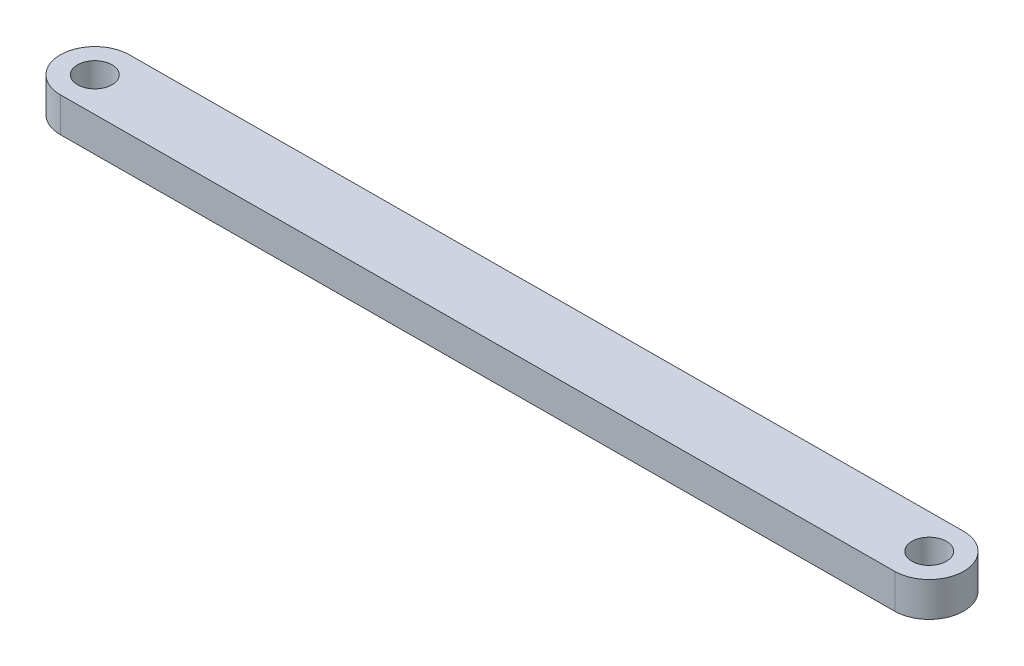
ISO-10303-21;
HEADER;
FILE_DESCRIPTION(('STEP AP214'),'2;1');
FILE_NAME('part.step','',(''),(''),'','','');
FILE_SCHEMA(('AUTOMOTIVE_DESIGN { 1 0 10303 214 1 1 1 1 }'));
ENDSEC;
DATA;
#1=APPLICATION_CONTEXT('core data for automotive mechanical design processes');
#2=APPLICATION_PROTOCOL_DEFINITION('international standard','automotive_design',2000,#1);
#3=PRODUCT_CONTEXT('',#1,'mechanical');
#4=PRODUCT('Part','Part','',(#3));
#5=PRODUCT_RELATED_PRODUCT_CATEGORY('part','',(#4));
#6=PRODUCT_DEFINITION_FORMATION('','',#4);
#7=PRODUCT_DEFINITION_CONTEXT('part definition',#1,'design');
#8=PRODUCT_DEFINITION('design','',#6,#7);
#9=PRODUCT_DEFINITION_SHAPE('','',#8);
#10=(LENGTH_UNIT() NAMED_UNIT(*) SI_UNIT(.MILLI.,.METRE.));
#11=(NAMED_UNIT(*) PLANE_ANGLE_UNIT() SI_UNIT($,.RADIAN.));
#12=(NAMED_UNIT(*) SI_UNIT($,.STERADIAN.) SOLID_ANGLE_UNIT());
#13=UNCERTAINTY_MEASURE_WITH_UNIT(LENGTH_MEASURE(1.E-05),#10,'distance_accuracy_value','');
#14=(GEOMETRIC_REPRESENTATION_CONTEXT(3) GLOBAL_UNCERTAINTY_ASSIGNED_CONTEXT((#13)) GLOBAL_UNIT_ASSIGNED_CONTEXT((#10,
#11,#12)) REPRESENTATION_CONTEXT('',''));
#15=CARTESIAN_POINT('',(0.,0.,0.));
#16=DIRECTION('',(0.,0.,1.));
#17=DIRECTION('',(1.,0.,0.));
#18=AXIS2_PLACEMENT_3D('',#15,#16,#17);
#19=CARTESIAN_POINT('',(0.,12.7,0.));
#20=DIRECTION('',(0.,1.,0.));
#21=DIRECTION('',(0.,0.,1.));
#22=AXIS2_PLACEMENT_3D('',#19,#20,#21);
#23=PLANE('',#22);
#24=CARTESIAN_POINT('',(0.,12.7,0.));
#25=DIRECTION('',(0.,1.,0.));
#26=DIRECTION('',(0.,0.,1.));
#27=AXIS2_PLACEMENT_3D('',#24,#25,#26);
#28=CIRCLE('',#27,6.35);
#29=CARTESIAN_POINT('',(0.,12.7,6.35));
#30=VERTEX_POINT('',#29);
#31=EDGE_CURVE('E100',#30,#30,#28,.T.);
#32=ORIENTED_EDGE('',*,*,#31,.F.);
#33=EDGE_LOOP('',(#32));
#34=FACE_BOUND('',#33,.T.);
#35=CARTESIAN_POINT('',(0.,12.7,0.));
#36=DIRECTION('',(0.,1.,0.));
#37=DIRECTION('',(0.,0.,1.));
#38=AXIS2_PLACEMENT_3D('',#35,#36,#37);
#39=CIRCLE('',#38,12.7);
#40=CARTESIAN_POINT('',(-0.0688932609002899,12.7,-12.6998131371529));
#41=VERTEX_POINT('',#40);
#42=CARTESIAN_POINT('',(0.0688932609002899,12.7,12.6998131371529));
#43=VERTEX_POINT('',#42);
#44=EDGE_CURVE('E85',#41,#43,#39,.T.);
#45=ORIENTED_EDGE('',*,*,#44,.T.);
#46=DIRECTION('',(0.999985286389996,0.,-0.00542466621262125));
#47=VECTOR('',#46,1.);
#48=CARTESIAN_POINT('',(0.0688932609002899,12.7,12.6998131371529));
#49=LINE('',#48,#47);
#50=CARTESIAN_POINT('',(304.8688932609,12.7,11.0463505471423));
#51=VERTEX_POINT('',#50);
#52=EDGE_CURVE('E80',#43,#51,#49,.T.);
#53=ORIENTED_EDGE('',*,*,#52,.T.);
#54=CARTESIAN_POINT('',(304.8,12.7,-1.65346259001067));
#55=DIRECTION('',(0.,1.,0.));
#56=DIRECTION('',(0.,0.,1.));
#57=AXIS2_PLACEMENT_3D('',#54,#55,#56);
#58=CIRCLE('',#57,12.7);
#59=CARTESIAN_POINT('',(304.7311067391,12.7,-14.3532757271636));
#60=VERTEX_POINT('',#59);
#61=EDGE_CURVE('E83',#51,#60,#58,.T.);
#62=ORIENTED_EDGE('',*,*,#61,.T.);
#63=DIRECTION('',(-0.999985286389996,0.,0.00542466621262125));
#64=VECTOR('',#63,1.);
#65=CARTESIAN_POINT('',(-0.0688932609002899,12.7,-12.6998131371529));
#66=LINE('',#65,#64);
#67=EDGE_CURVE('E50',#60,#41,#66,.T.);
#68=ORIENTED_EDGE('',*,*,#67,.T.);
#69=EDGE_LOOP('',(#45,#53,#62,#68));
#70=FACE_BOUND('',#69,.T.);
#71=CARTESIAN_POINT('',(304.8,12.7,-1.65346259001067));
#72=DIRECTION('',(0.,1.,0.));
#73=DIRECTION('',(0.,0.,1.));
#74=AXIS2_PLACEMENT_3D('',#71,#72,#73);
#75=CIRCLE('',#74,6.35);
#76=CARTESIAN_POINT('',(304.8,12.7,4.69653740998933));
#77=VERTEX_POINT('',#76);
#78=EDGE_CURVE('E115',#77,#77,#75,.T.);
#79=ORIENTED_EDGE('',*,*,#78,.F.);
#80=EDGE_LOOP('',(#79));
#81=FACE_BOUND('',#80,.T.);
#82=ADVANCED_FACE('F33',(#34,#70,#81),#23,.T.);
#83=CARTESIAN_POINT('',(0.,0.,0.));
#84=DIRECTION('',(0.,1.,0.));
#85=DIRECTION('',(0.,0.,1.));
#86=AXIS2_PLACEMENT_3D('',#83,#84,#85);
#87=PLANE('',#86);
#88=CARTESIAN_POINT('',(0.,0.,0.));
#89=DIRECTION('',(0.,1.,0.));
#90=DIRECTION('',(0.,0.,1.));
#91=AXIS2_PLACEMENT_3D('',#88,#89,#90);
#92=CIRCLE('',#91,12.7);
#93=CARTESIAN_POINT('',(-0.0688932609002899,0.,-12.6998131371529));
#94=VERTEX_POINT('',#93);
#95=CARTESIAN_POINT('',(0.0688932609002899,0.,12.6998131371529));
#96=VERTEX_POINT('',#95);
#97=EDGE_CURVE('E97',#94,#96,#92,.T.);
#98=ORIENTED_EDGE('',*,*,#97,.F.);
#99=DIRECTION('',(-0.999985286389996,0.,0.00542466621262125));
#100=VECTOR('',#99,1.);
#101=CARTESIAN_POINT('',(-0.0688932609002899,0.,-12.6998131371529));
#102=LINE('',#101,#100);
#103=CARTESIAN_POINT('',(304.7311067391,0.,-14.3532757271636));
#104=VERTEX_POINT('',#103);
#105=EDGE_CURVE('E73',#104,#94,#102,.T.);
#106=ORIENTED_EDGE('',*,*,#105,.F.);
#107=CARTESIAN_POINT('',(304.8,0.,-1.65346259001067));
#108=DIRECTION('',(0.,1.,0.));
#109=DIRECTION('',(0.,0.,1.));
#110=AXIS2_PLACEMENT_3D('',#107,#108,#109);
#111=CIRCLE('',#110,12.7);
#112=CARTESIAN_POINT('',(304.8688932609,0.,11.0463505471423));
#113=VERTEX_POINT('',#112);
#114=EDGE_CURVE('E67',#113,#104,#111,.T.);
#115=ORIENTED_EDGE('',*,*,#114,.F.);
#116=DIRECTION('',(0.999985286389996,0.,-0.00542466621262125));
#117=VECTOR('',#116,1.);
#118=CARTESIAN_POINT('',(0.0688932609002899,0.,12.6998131371529));
#119=LINE('',#118,#117);
#120=EDGE_CURVE('E89',#96,#113,#119,.T.);
#121=ORIENTED_EDGE('',*,*,#120,.F.);
#122=EDGE_LOOP('',(#98,#106,#115,#121));
#123=FACE_BOUND('',#122,.T.);
#124=CARTESIAN_POINT('',(0.,0.,0.));
#125=DIRECTION('',(0.,1.,0.));
#126=DIRECTION('',(0.,0.,1.));
#127=AXIS2_PLACEMENT_3D('',#124,#125,#126);
#128=CIRCLE('',#127,6.35);
#129=CARTESIAN_POINT('',(0.,0.,6.35));
#130=VERTEX_POINT('',#129);
#131=EDGE_CURVE('E112',#130,#130,#128,.T.);
#132=ORIENTED_EDGE('',*,*,#131,.T.);
#133=EDGE_LOOP('',(#132));
#134=FACE_BOUND('',#133,.T.);
#135=CARTESIAN_POINT('',(304.8,0.,-1.65346259001067));
#136=DIRECTION('',(0.,1.,0.));
#137=DIRECTION('',(0.,0.,1.));
#138=AXIS2_PLACEMENT_3D('',#135,#136,#137);
#139=CIRCLE('',#138,6.35);
#140=CARTESIAN_POINT('',(304.8,0.,4.69653740998933));
#141=VERTEX_POINT('',#140);
#142=EDGE_CURVE('E118',#141,#141,#139,.T.);
#143=ORIENTED_EDGE('',*,*,#142,.T.);
#144=EDGE_LOOP('',(#143));
#145=FACE_BOUND('',#144,.T.);
#146=ADVANCED_FACE('F108',(#123,#134,#145),#87,.F.);
#147=CARTESIAN_POINT('',(0.,12.7,0.));
#148=DIRECTION('',(0.,-1.,0.));
#149=DIRECTION('',(0.,0.,-1.));
#150=AXIS2_PLACEMENT_3D('',#147,#148,#149);
#151=CYLINDRICAL_SURFACE('',#150,12.7);
#152=ORIENTED_EDGE('',*,*,#97,.T.);
#153=DIRECTION('',(0.,-1.,0.));
#154=VECTOR('',#153,1.);
#155=CARTESIAN_POINT('',(0.0688932609002899,12.7,12.6998131371529));
#156=LINE('',#155,#154);
#157=EDGE_CURVE('E11',#43,#96,#156,.T.);
#158=ORIENTED_EDGE('',*,*,#157,.F.);
#159=ORIENTED_EDGE('',*,*,#44,.F.);
#160=DIRECTION('',(0.,-1.,0.));
#161=VECTOR('',#160,1.);
#162=CARTESIAN_POINT('',(-0.0688932609002899,12.7,-12.6998131371529));
#163=LINE('',#162,#161);
#164=EDGE_CURVE('E93',#41,#94,#163,.T.);
#165=ORIENTED_EDGE('',*,*,#164,.T.);
#166=EDGE_LOOP('',(#152,#158,#159,#165));
#167=FACE_BOUND('',#166,.T.);
#168=ADVANCED_FACE('F35',(#167),#151,.T.);
#169=CARTESIAN_POINT('',(0.0688932609002899,12.7,12.6998131371529));
#170=DIRECTION('',(-0.00542466621262125,0.,-0.999985286389996));
#171=DIRECTION('',(-0.999985286389996,0.,0.00542466621262125));
#172=AXIS2_PLACEMENT_3D('',#169,#170,#171);
#173=PLANE('',#172);
#174=ORIENTED_EDGE('',*,*,#120,.T.);
#175=DIRECTION('',(0.,-1.,0.));
#176=VECTOR('',#175,1.);
#177=CARTESIAN_POINT('',(304.8688932609,12.7,11.0463505471423));
#178=LINE('',#177,#176);
#179=EDGE_CURVE('E42',#51,#113,#178,.T.);
#180=ORIENTED_EDGE('',*,*,#179,.F.);
#181=ORIENTED_EDGE('',*,*,#52,.F.);
#182=ORIENTED_EDGE('',*,*,#157,.T.);
#183=EDGE_LOOP('',(#174,#180,#181,#182));
#184=FACE_BOUND('',#183,.T.);
#185=ADVANCED_FACE('F88',(#184),#173,.F.);
#186=CARTESIAN_POINT('',(304.8,12.7,-1.65346259001067));
#187=DIRECTION('',(0.,-1.,0.));
#188=DIRECTION('',(0.,0.,-1.));
#189=AXIS2_PLACEMENT_3D('',#186,#187,#188);
#190=CYLINDRICAL_SURFACE('',#189,12.7);
#191=ORIENTED_EDGE('',*,*,#114,.T.);
#192=DIRECTION('',(0.,-1.,0.));
#193=VECTOR('',#192,1.);
#194=CARTESIAN_POINT('',(304.7311067391,12.7,-14.3532757271636));
#195=LINE('',#194,#193);
#196=EDGE_CURVE('E90',#60,#104,#195,.T.);
#197=ORIENTED_EDGE('',*,*,#196,.F.);
#198=ORIENTED_EDGE('',*,*,#61,.F.);
#199=ORIENTED_EDGE('',*,*,#179,.T.);
#200=EDGE_LOOP('',(#191,#197,#198,#199));
#201=FACE_BOUND('',#200,.T.);
#202=ADVANCED_FACE('F91',(#201),#190,.T.);
#203=CARTESIAN_POINT('',(-0.0688932609002899,12.7,-12.6998131371529));
#204=DIRECTION('',(0.00542466621262124,0.,0.999985286389996));
#205=DIRECTION('',(0.999985286389996,0.,-0.00542466621262125));
#206=AXIS2_PLACEMENT_3D('',#203,#204,#205);
#207=PLANE('',#206);
#208=ORIENTED_EDGE('',*,*,#105,.T.);
#209=ORIENTED_EDGE('',*,*,#164,.F.);
#210=ORIENTED_EDGE('',*,*,#67,.F.);
#211=ORIENTED_EDGE('',*,*,#196,.T.);
#212=EDGE_LOOP('',(#208,#209,#210,#211));
#213=FACE_BOUND('',#212,.T.);
#214=ADVANCED_FACE('F105',(#213),#207,.F.);
#215=CARTESIAN_POINT('',(0.,12.7,0.));
#216=DIRECTION('',(0.,-1.,0.));
#217=DIRECTION('',(0.,0.,-1.));
#218=AXIS2_PLACEMENT_3D('',#215,#216,#217);
#219=CYLINDRICAL_SURFACE('',#218,6.35);
#220=ORIENTED_EDGE('',*,*,#31,.T.);
#221=EDGE_LOOP('',(#220));
#222=FACE_BOUND('',#221,.T.);
#223=ORIENTED_EDGE('',*,*,#131,.F.);
#224=EDGE_LOOP('',(#223));
#225=FACE_BOUND('',#224,.T.);
#226=ADVANCED_FACE('F135',(#222,#225),#219,.F.);
#227=CARTESIAN_POINT('',(304.8,12.7,-1.65346259001067));
#228=DIRECTION('',(0.,-1.,0.));
#229=DIRECTION('',(0.,0.,-1.));
#230=AXIS2_PLACEMENT_3D('',#227,#228,#229);
#231=CYLINDRICAL_SURFACE('',#230,6.35);
#232=ORIENTED_EDGE('',*,*,#78,.T.);
#233=EDGE_LOOP('',(#232));
#234=FACE_BOUND('',#233,.T.);
#235=ORIENTED_EDGE('',*,*,#142,.F.);
#236=EDGE_LOOP('',(#235));
#237=FACE_BOUND('',#236,.T.);
#238=ADVANCED_FACE('F124',(#234,#237),#231,.F.);
#239=CLOSED_SHELL('',(#82,#146,#168,#185,#202,#214,#226,#238));
#240=MANIFOLD_SOLID_BREP('B2',#239);
#241=ADVANCED_BREP_SHAPE_REPRESENTATION('',(#18,#240),#14);
#242=SHAPE_DEFINITION_REPRESENTATION(#9,#241);
ENDSEC;
END-ISO-10303-21;
